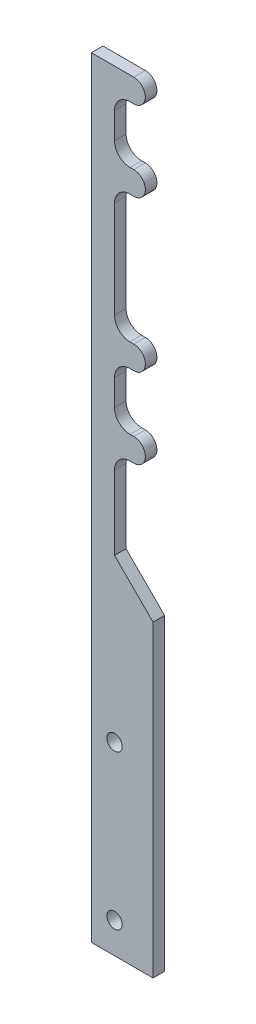
ISO-10303-21;
HEADER;
FILE_DESCRIPTION(('STEP AP214'),'2;1');
FILE_NAME('part.step','',(''),(''),'','','');
FILE_SCHEMA(('AUTOMOTIVE_DESIGN { 1 0 10303 214 1 1 1 1 }'));
ENDSEC;
DATA;
#1=APPLICATION_CONTEXT('core data for automotive mechanical design processes');
#2=APPLICATION_PROTOCOL_DEFINITION('international standard','automotive_design',2000,#1);
#3=PRODUCT_CONTEXT('',#1,'mechanical');
#4=PRODUCT('Part','Part','',(#3));
#5=PRODUCT_RELATED_PRODUCT_CATEGORY('part','',(#4));
#6=PRODUCT_DEFINITION_FORMATION('','',#4);
#7=PRODUCT_DEFINITION_CONTEXT('part definition',#1,'design');
#8=PRODUCT_DEFINITION('design','',#6,#7);
#9=PRODUCT_DEFINITION_SHAPE('','',#8);
#10=(LENGTH_UNIT() NAMED_UNIT(*) SI_UNIT(.MILLI.,.METRE.));
#11=(NAMED_UNIT(*) PLANE_ANGLE_UNIT() SI_UNIT($,.RADIAN.));
#12=(NAMED_UNIT(*) SI_UNIT($,.STERADIAN.) SOLID_ANGLE_UNIT());
#13=UNCERTAINTY_MEASURE_WITH_UNIT(LENGTH_MEASURE(1.E-05),#10,'distance_accuracy_value','');
#14=(GEOMETRIC_REPRESENTATION_CONTEXT(3) GLOBAL_UNCERTAINTY_ASSIGNED_CONTEXT((#13)) GLOBAL_UNIT_ASSIGNED_CONTEXT((#10,
#11,#12)) REPRESENTATION_CONTEXT('',''));
#15=CARTESIAN_POINT('',(0.,0.,0.));
#16=DIRECTION('',(0.,0.,1.));
#17=DIRECTION('',(1.,0.,0.));
#18=AXIS2_PLACEMENT_3D('',#15,#16,#17);
#19=CARTESIAN_POINT('',(0.,-51.6961524227066,1.5));
#20=DIRECTION('',(0.,1.,0.));
#21=DIRECTION('',(0.,0.,1.));
#22=AXIS2_PLACEMENT_3D('',#19,#20,#21);
#23=PLANE('',#22);
#24=DIRECTION('',(1.,0.,0.));
#25=VECTOR('',#24,1.);
#26=CARTESIAN_POINT('',(0.,-51.6961524227066,1.5));
#27=LINE('',#26,#25);
#28=CARTESIAN_POINT('',(-3.49999999999998,-51.6961524227066,1.5));
#29=VERTEX_POINT('',#28);
#30=CARTESIAN_POINT('',(-3.,-51.6961524227066,1.5));
#31=VERTEX_POINT('',#30);
#32=EDGE_CURVE('E216',#29,#31,#27,.T.);
#33=ORIENTED_EDGE('',*,*,#32,.F.);
#34=DIRECTION('',(0.,0.,-1.));
#35=VECTOR('',#34,1.);
#36=CARTESIAN_POINT('',(-3.49999999999998,-51.6961524227066,0.));
#37=LINE('',#36,#35);
#38=CARTESIAN_POINT('',(-3.49999999999998,-51.6961524227066,0.));
#39=VERTEX_POINT('',#38);
#40=EDGE_CURVE('E243',#29,#39,#37,.T.);
#41=ORIENTED_EDGE('',*,*,#40,.T.);
#42=DIRECTION('',(1.,0.,0.));
#43=VECTOR('',#42,1.);
#44=CARTESIAN_POINT('',(0.,-51.6961524227066,0.));
#45=LINE('',#44,#43);
#46=CARTESIAN_POINT('',(-3.,-51.6961524227066,0.));
#47=VERTEX_POINT('',#46);
#48=EDGE_CURVE('E241',#39,#47,#45,.T.);
#49=ORIENTED_EDGE('',*,*,#48,.T.);
#50=DIRECTION('',(0.,0.,-1.));
#51=VECTOR('',#50,1.);
#52=CARTESIAN_POINT('',(-3.,-51.6961524227066,1.5));
#53=LINE('',#52,#51);
#54=EDGE_CURVE('E235',#31,#47,#53,.T.);
#55=ORIENTED_EDGE('',*,*,#54,.F.);
#56=EDGE_LOOP('',(#33,#41,#49,#55));
#57=FACE_BOUND('',#56,.T.);
#58=ADVANCED_FACE('F36',(#57),#23,.F.);
#59=CARTESIAN_POINT('',(-3.,-50.1961524227066,1.5));
#60=DIRECTION('',(0.,0.,-1.));
#61=DIRECTION('',(-1.,0.,0.));
#62=AXIS2_PLACEMENT_3D('',#59,#60,#61);
#63=CYLINDRICAL_SURFACE('',#62,1.5);
#64=CARTESIAN_POINT('',(-3.,-50.1961524227066,0.));
#65=DIRECTION('',(0.,0.,1.));
#66=DIRECTION('',(1.,0.,0.));
#67=AXIS2_PLACEMENT_3D('',#64,#65,#66);
#68=CIRCLE('',#67,1.5);
#69=CARTESIAN_POINT('',(-3.,-48.6961524227066,0.));
#70=VERTEX_POINT('',#69);
#71=EDGE_CURVE('E362',#47,#70,#68,.T.);
#72=ORIENTED_EDGE('',*,*,#71,.T.);
#73=DIRECTION('',(0.,0.,-1.));
#74=VECTOR('',#73,1.);
#75=CARTESIAN_POINT('',(-3.,-48.6961524227066,1.5));
#76=LINE('',#75,#74);
#77=CARTESIAN_POINT('',(-3.,-48.6961524227066,1.5));
#78=VERTEX_POINT('',#77);
#79=EDGE_CURVE('E237',#78,#70,#76,.T.);
#80=ORIENTED_EDGE('',*,*,#79,.F.);
#81=CARTESIAN_POINT('',(-3.,-50.1961524227066,1.5));
#82=DIRECTION('',(0.,0.,1.));
#83=DIRECTION('',(1.,0.,0.));
#84=AXIS2_PLACEMENT_3D('',#81,#82,#83);
#85=CIRCLE('',#84,1.5);
#86=EDGE_CURVE('E221',#31,#78,#85,.T.);
#87=ORIENTED_EDGE('',*,*,#86,.F.);
#88=ORIENTED_EDGE('',*,*,#54,.T.);
#89=EDGE_LOOP('',(#72,#80,#87,#88));
#90=FACE_BOUND('',#89,.T.);
#91=ADVANCED_FACE('F234',(#90),#63,.T.);
#92=CARTESIAN_POINT('',(0.,-48.6961524227066,1.5));
#93=DIRECTION('',(0.,1.,0.));
#94=DIRECTION('',(0.,0.,1.));
#95=AXIS2_PLACEMENT_3D('',#92,#93,#94);
#96=PLANE('',#95);
#97=DIRECTION('',(1.,0.,0.));
#98=VECTOR('',#97,1.);
#99=CARTESIAN_POINT('',(0.,-48.6961524227066,0.));
#100=LINE('',#99,#98);
#101=CARTESIAN_POINT('',(-3.49999999999998,-48.6961524227066,0.));
#102=VERTEX_POINT('',#101);
#103=EDGE_CURVE('E364',#102,#70,#100,.T.);
#104=ORIENTED_EDGE('',*,*,#103,.F.);
#105=DIRECTION('',(0.,0.,-1.));
#106=VECTOR('',#105,1.);
#107=CARTESIAN_POINT('',(-3.49999999999998,-48.6961524227066,1.5));
#108=LINE('',#107,#106);
#109=CARTESIAN_POINT('',(-3.49999999999998,-48.6961524227066,1.5));
#110=VERTEX_POINT('',#109);
#111=EDGE_CURVE('E257',#102,#110,#108,.F.);
#112=ORIENTED_EDGE('',*,*,#111,.T.);
#113=DIRECTION('',(1.,0.,0.));
#114=VECTOR('',#113,1.);
#115=CARTESIAN_POINT('',(0.,-48.6961524227066,1.5));
#116=LINE('',#115,#114);
#117=EDGE_CURVE('E238',#110,#78,#116,.T.);
#118=ORIENTED_EDGE('',*,*,#117,.T.);
#119=ORIENTED_EDGE('',*,*,#79,.T.);
#120=EDGE_LOOP('',(#104,#112,#118,#119));
#121=FACE_BOUND('',#120,.T.);
#122=ADVANCED_FACE('F462',(#121),#96,.T.);
#123=CARTESIAN_POINT('',(-5.49999999999998,0.,1.5));
#124=DIRECTION('',(1.,0.,0.));
#125=DIRECTION('',(0.,0.,-1.));
#126=AXIS2_PLACEMENT_3D('',#123,#124,#125);
#127=PLANE('',#126);
#128=DIRECTION('',(0.,-1.,0.));
#129=VECTOR('',#128,1.);
#130=CARTESIAN_POINT('',(-5.49999999999998,0.,1.5));
#131=LINE('',#130,#129);
#132=CARTESIAN_POINT('',(-5.49999999999998,-43.3038475772934,1.5));
#133=VERTEX_POINT('',#132);
#134=CARTESIAN_POINT('',(-5.49999999999998,-46.6961524227066,1.5));
#135=VERTEX_POINT('',#134);
#136=EDGE_CURVE('E319',#133,#135,#131,.T.);
#137=ORIENTED_EDGE('',*,*,#136,.T.);
#138=DIRECTION('',(0.,0.,-1.));
#139=VECTOR('',#138,1.);
#140=CARTESIAN_POINT('',(-5.49999999999998,-46.6961524227066,0.));
#141=LINE('',#140,#139);
#142=CARTESIAN_POINT('',(-5.49999999999998,-46.6961524227066,0.));
#143=VERTEX_POINT('',#142);
#144=EDGE_CURVE('E254',#135,#143,#141,.T.);
#145=ORIENTED_EDGE('',*,*,#144,.T.);
#146=DIRECTION('',(0.,-1.,0.));
#147=VECTOR('',#146,1.);
#148=CARTESIAN_POINT('',(-5.49999999999998,0.,0.));
#149=LINE('',#148,#147);
#150=CARTESIAN_POINT('',(-5.49999999999998,-43.3038475772934,0.));
#151=VERTEX_POINT('',#150);
#152=EDGE_CURVE('E366',#151,#143,#149,.T.);
#153=ORIENTED_EDGE('',*,*,#152,.F.);
#154=DIRECTION('',(0.,0.,-1.));
#155=VECTOR('',#154,1.);
#156=CARTESIAN_POINT('',(-5.49999999999998,-43.3038475772934,1.5));
#157=LINE('',#156,#155);
#158=EDGE_CURVE('E252',#151,#133,#157,.F.);
#159=ORIENTED_EDGE('',*,*,#158,.T.);
#160=EDGE_LOOP('',(#137,#145,#153,#159));
#161=FACE_BOUND('',#160,.T.);
#162=ADVANCED_FACE('F453',(#161),#127,.T.);
#163=CARTESIAN_POINT('',(0.,-41.3038475772934,1.5));
#164=DIRECTION('',(0.,-1.,0.));
#165=DIRECTION('',(0.,0.,-1.));
#166=AXIS2_PLACEMENT_3D('',#163,#164,#165);
#167=PLANE('',#166);
#168=DIRECTION('',(-1.,0.,0.));
#169=VECTOR('',#168,1.);
#170=CARTESIAN_POINT('',(0.,-41.3038475772934,1.5));
#171=LINE('',#170,#169);
#172=CARTESIAN_POINT('',(-3.,-41.3038475772934,1.5));
#173=VERTEX_POINT('',#172);
#174=CARTESIAN_POINT('',(-3.49999999999998,-41.3038475772934,1.5));
#175=VERTEX_POINT('',#174);
#176=EDGE_CURVE('E322',#173,#175,#171,.T.);
#177=ORIENTED_EDGE('',*,*,#176,.T.);
#178=DIRECTION('',(0.,0.,-1.));
#179=VECTOR('',#178,1.);
#180=CARTESIAN_POINT('',(-3.49999999999998,-41.3038475772934,0.));
#181=LINE('',#180,#179);
#182=CARTESIAN_POINT('',(-3.49999999999998,-41.3038475772934,0.));
#183=VERTEX_POINT('',#182);
#184=EDGE_CURVE('E259',#175,#183,#181,.T.);
#185=ORIENTED_EDGE('',*,*,#184,.T.);
#186=DIRECTION('',(-1.,0.,0.));
#187=VECTOR('',#186,1.);
#188=CARTESIAN_POINT('',(0.,-41.3038475772934,0.));
#189=LINE('',#188,#187);
#190=CARTESIAN_POINT('',(-3.,-41.3038475772934,0.));
#191=VERTEX_POINT('',#190);
#192=EDGE_CURVE('E369',#191,#183,#189,.T.);
#193=ORIENTED_EDGE('',*,*,#192,.F.);
#194=DIRECTION('',(0.,0.,-1.));
#195=VECTOR('',#194,1.);
#196=CARTESIAN_POINT('',(-3.,-41.3038475772934,1.5));
#197=LINE('',#196,#195);
#198=EDGE_CURVE('E247',#173,#191,#197,.T.);
#199=ORIENTED_EDGE('',*,*,#198,.F.);
#200=EDGE_LOOP('',(#177,#185,#193,#199));
#201=FACE_BOUND('',#200,.T.);
#202=ADVANCED_FACE('F445',(#201),#167,.T.);
#203=CARTESIAN_POINT('',(-3.,-39.8038475772934,1.5));
#204=DIRECTION('',(0.,0.,-1.));
#205=DIRECTION('',(-1.,0.,0.));
#206=AXIS2_PLACEMENT_3D('',#203,#204,#205);
#207=CYLINDRICAL_SURFACE('',#206,1.5);
#208=CARTESIAN_POINT('',(-3.,-39.8038475772934,0.));
#209=DIRECTION('',(0.,0.,1.));
#210=DIRECTION('',(1.,0.,0.));
#211=AXIS2_PLACEMENT_3D('',#208,#209,#210);
#212=CIRCLE('',#211,1.5);
#213=CARTESIAN_POINT('',(-3.,-38.3038475772934,0.));
#214=VERTEX_POINT('',#213);
#215=EDGE_CURVE('E372',#191,#214,#212,.T.);
#216=ORIENTED_EDGE('',*,*,#215,.T.);
#217=DIRECTION('',(0.,0.,-1.));
#218=VECTOR('',#217,1.);
#219=CARTESIAN_POINT('',(-3.,-38.3038475772934,1.5));
#220=LINE('',#219,#218);
#221=CARTESIAN_POINT('',(-3.,-38.3038475772934,1.5));
#222=VERTEX_POINT('',#221);
#223=EDGE_CURVE('E432',#222,#214,#220,.T.);
#224=ORIENTED_EDGE('',*,*,#223,.F.);
#225=CARTESIAN_POINT('',(-3.,-39.8038475772934,1.5));
#226=DIRECTION('',(0.,0.,1.));
#227=DIRECTION('',(1.,0.,0.));
#228=AXIS2_PLACEMENT_3D('',#225,#226,#227);
#229=CIRCLE('',#228,1.5);
#230=EDGE_CURVE('E325',#173,#222,#229,.T.);
#231=ORIENTED_EDGE('',*,*,#230,.F.);
#232=ORIENTED_EDGE('',*,*,#198,.T.);
#233=EDGE_LOOP('',(#216,#224,#231,#232));
#234=FACE_BOUND('',#233,.T.);
#235=ADVANCED_FACE('F437',(#234),#207,.T.);
#236=CARTESIAN_POINT('',(0.,-38.3038475772934,1.5));
#237=DIRECTION('',(0.,-1.,0.));
#238=DIRECTION('',(0.,0.,-1.));
#239=AXIS2_PLACEMENT_3D('',#236,#237,#238);
#240=PLANE('',#239);
#241=DIRECTION('',(-1.,0.,0.));
#242=VECTOR('',#241,1.);
#243=CARTESIAN_POINT('',(0.,-38.3038475772934,0.));
#244=LINE('',#243,#242);
#245=CARTESIAN_POINT('',(-3.49999999999998,-38.3038475772934,0.));
#246=VERTEX_POINT('',#245);
#247=EDGE_CURVE('E374',#214,#246,#244,.T.);
#248=ORIENTED_EDGE('',*,*,#247,.T.);
#249=DIRECTION('',(0.,0.,-1.));
#250=VECTOR('',#249,1.);
#251=CARTESIAN_POINT('',(-3.49999999999998,-38.3038475772934,1.5));
#252=LINE('',#251,#250);
#253=CARTESIAN_POINT('',(-3.49999999999998,-38.3038475772934,1.5));
#254=VERTEX_POINT('',#253);
#255=EDGE_CURVE('E267',#246,#254,#252,.F.);
#256=ORIENTED_EDGE('',*,*,#255,.T.);
#257=DIRECTION('',(-1.,0.,0.));
#258=VECTOR('',#257,1.);
#259=CARTESIAN_POINT('',(0.,-38.3038475772934,1.5));
#260=LINE('',#259,#258);
#261=EDGE_CURVE('E327',#222,#254,#260,.T.);
#262=ORIENTED_EDGE('',*,*,#261,.F.);
#263=ORIENTED_EDGE('',*,*,#223,.T.);
#264=EDGE_LOOP('',(#248,#256,#262,#263));
#265=FACE_BOUND('',#264,.T.);
#266=ADVANCED_FACE('F496',(#265),#240,.F.);
#267=CARTESIAN_POINT('',(-5.49999999999999,0.,1.5));
#268=DIRECTION('',(1.,0.,0.));
#269=DIRECTION('',(0.,1.,0.));
#270=AXIS2_PLACEMENT_3D('',#267,#268,#269);
#271=PLANE('',#270);
#272=DIRECTION('',(0.,-1.,0.));
#273=VECTOR('',#272,1.);
#274=CARTESIAN_POINT('',(-5.49999999999999,0.,1.5));
#275=LINE('',#274,#273);
#276=CARTESIAN_POINT('',(-5.49999999999998,-23.6961524227067,1.5));
#277=VERTEX_POINT('',#276);
#278=CARTESIAN_POINT('',(-5.49999999999998,-36.3038475772934,1.5));
#279=VERTEX_POINT('',#278);
#280=EDGE_CURVE('E330',#277,#279,#275,.T.);
#281=ORIENTED_EDGE('',*,*,#280,.T.);
#282=DIRECTION('',(0.,0.,-1.));
#283=VECTOR('',#282,1.);
#284=CARTESIAN_POINT('',(-5.49999999999998,-36.3038475772934,1.5));
#285=LINE('',#284,#283);
#286=CARTESIAN_POINT('',(-5.49999999999998,-36.3038475772934,0.));
#287=VERTEX_POINT('',#286);
#288=EDGE_CURVE('E264',#279,#287,#285,.T.);
#289=ORIENTED_EDGE('',*,*,#288,.T.);
#290=DIRECTION('',(0.,-1.,0.));
#291=VECTOR('',#290,1.);
#292=CARTESIAN_POINT('',(-5.49999999999999,0.,0.));
#293=LINE('',#292,#291);
#294=CARTESIAN_POINT('',(-5.49999999999998,-23.6961524227067,0.));
#295=VERTEX_POINT('',#294);
#296=EDGE_CURVE('E377',#295,#287,#293,.T.);
#297=ORIENTED_EDGE('',*,*,#296,.F.);
#298=DIRECTION('',(0.,0.,-1.));
#299=VECTOR('',#298,1.);
#300=CARTESIAN_POINT('',(-5.49999999999998,-23.6961524227067,1.5));
#301=LINE('',#300,#299);
#302=EDGE_CURVE('E262',#295,#277,#301,.F.);
#303=ORIENTED_EDGE('',*,*,#302,.T.);
#304=EDGE_LOOP('',(#281,#289,#297,#303));
#305=FACE_BOUND('',#304,.T.);
#306=ADVANCED_FACE('F499',(#305),#271,.T.);
#307=CARTESIAN_POINT('',(0.,-21.6961524227066,1.5));
#308=DIRECTION('',(0.,-1.,0.));
#309=DIRECTION('',(0.,0.,-1.));
#310=AXIS2_PLACEMENT_3D('',#307,#308,#309);
#311=PLANE('',#310);
#312=DIRECTION('',(-1.,0.,0.));
#313=VECTOR('',#312,1.);
#314=CARTESIAN_POINT('',(0.,-21.6961524227066,1.5));
#315=LINE('',#314,#313);
#316=CARTESIAN_POINT('',(-3.,-21.6961524227066,1.5));
#317=VERTEX_POINT('',#316);
#318=CARTESIAN_POINT('',(-3.49999999999998,-21.6961524227066,1.5));
#319=VERTEX_POINT('',#318);
#320=EDGE_CURVE('E333',#317,#319,#315,.T.);
#321=ORIENTED_EDGE('',*,*,#320,.T.);
#322=DIRECTION('',(0.,0.,-1.));
#323=VECTOR('',#322,1.);
#324=CARTESIAN_POINT('',(-3.49999999999998,-21.6961524227066,0.));
#325=LINE('',#324,#323);
#326=CARTESIAN_POINT('',(-3.49999999999998,-21.6961524227066,0.));
#327=VERTEX_POINT('',#326);
#328=EDGE_CURVE('E269',#319,#327,#325,.T.);
#329=ORIENTED_EDGE('',*,*,#328,.T.);
#330=DIRECTION('',(-1.,0.,0.));
#331=VECTOR('',#330,1.);
#332=CARTESIAN_POINT('',(0.,-21.6961524227066,0.));
#333=LINE('',#332,#331);
#334=CARTESIAN_POINT('',(-3.,-21.6961524227066,0.));
#335=VERTEX_POINT('',#334);
#336=EDGE_CURVE('E380',#335,#327,#333,.T.);
#337=ORIENTED_EDGE('',*,*,#336,.F.);
#338=DIRECTION('',(0.,0.,-1.));
#339=VECTOR('',#338,1.);
#340=CARTESIAN_POINT('',(-3.,-21.6961524227066,1.5));
#341=LINE('',#340,#339);
#342=EDGE_CURVE('E430',#317,#335,#341,.T.);
#343=ORIENTED_EDGE('',*,*,#342,.F.);
#344=EDGE_LOOP('',(#321,#329,#337,#343));
#345=FACE_BOUND('',#344,.T.);
#346=ADVANCED_FACE('F503',(#345),#311,.T.);
#347=CARTESIAN_POINT('',(-3.,-20.1961524227066,1.5));
#348=DIRECTION('',(0.,0.,-1.));
#349=DIRECTION('',(-1.,0.,0.));
#350=AXIS2_PLACEMENT_3D('',#347,#348,#349);
#351=CYLINDRICAL_SURFACE('',#350,1.5);
#352=CARTESIAN_POINT('',(-3.,-20.1961524227066,0.));
#353=DIRECTION('',(0.,0.,1.));
#354=DIRECTION('',(1.,0.,0.));
#355=AXIS2_PLACEMENT_3D('',#352,#353,#354);
#356=CIRCLE('',#355,1.5);
#357=CARTESIAN_POINT('',(-3.,-18.6961524227066,0.));
#358=VERTEX_POINT('',#357);
#359=EDGE_CURVE('E383',#335,#358,#356,.T.);
#360=ORIENTED_EDGE('',*,*,#359,.T.);
#361=DIRECTION('',(0.,0.,-1.));
#362=VECTOR('',#361,1.);
#363=CARTESIAN_POINT('',(-3.,-18.6961524227066,1.5));
#364=LINE('',#363,#362);
#365=CARTESIAN_POINT('',(-3.,-18.6961524227066,1.5));
#366=VERTEX_POINT('',#365);
#367=EDGE_CURVE('E427',#366,#358,#364,.T.);
#368=ORIENTED_EDGE('',*,*,#367,.F.);
#369=CARTESIAN_POINT('',(-3.,-20.1961524227066,1.5));
#370=DIRECTION('',(0.,0.,1.));
#371=DIRECTION('',(1.,0.,0.));
#372=AXIS2_PLACEMENT_3D('',#369,#370,#371);
#373=CIRCLE('',#372,1.5);
#374=EDGE_CURVE('E336',#317,#366,#373,.T.);
#375=ORIENTED_EDGE('',*,*,#374,.F.);
#376=ORIENTED_EDGE('',*,*,#342,.T.);
#377=EDGE_LOOP('',(#360,#368,#375,#376));
#378=FACE_BOUND('',#377,.T.);
#379=ADVANCED_FACE('F507',(#378),#351,.T.);
#380=CARTESIAN_POINT('',(0.,-18.6961524227066,1.5));
#381=DIRECTION('',(0.,1.,0.));
#382=DIRECTION('',(0.,0.,1.));
#383=AXIS2_PLACEMENT_3D('',#380,#381,#382);
#384=PLANE('',#383);
#385=DIRECTION('',(1.,0.,0.));
#386=VECTOR('',#385,1.);
#387=CARTESIAN_POINT('',(0.,-18.6961524227066,0.));
#388=LINE('',#387,#386);
#389=CARTESIAN_POINT('',(-3.49999999999998,-18.6961524227066,0.));
#390=VERTEX_POINT('',#389);
#391=EDGE_CURVE('E386',#390,#358,#388,.T.);
#392=ORIENTED_EDGE('',*,*,#391,.F.);
#393=DIRECTION('',(0.,0.,-1.));
#394=VECTOR('',#393,1.);
#395=CARTESIAN_POINT('',(-3.49999999999998,-18.6961524227066,1.5));
#396=LINE('',#395,#394);
#397=CARTESIAN_POINT('',(-3.49999999999998,-18.6961524227066,1.5));
#398=VERTEX_POINT('',#397);
#399=EDGE_CURVE('E277',#390,#398,#396,.F.);
#400=ORIENTED_EDGE('',*,*,#399,.T.);
#401=DIRECTION('',(1.,0.,0.));
#402=VECTOR('',#401,1.);
#403=CARTESIAN_POINT('',(0.,-18.6961524227066,1.5));
#404=LINE('',#403,#402);
#405=EDGE_CURVE('E339',#398,#366,#404,.T.);
#406=ORIENTED_EDGE('',*,*,#405,.T.);
#407=ORIENTED_EDGE('',*,*,#367,.T.);
#408=EDGE_LOOP('',(#392,#400,#406,#407));
#409=FACE_BOUND('',#408,.T.);
#410=ADVANCED_FACE('F511',(#409),#384,.T.);
#411=CARTESIAN_POINT('',(-5.49999999999998,0.,1.5));
#412=DIRECTION('',(1.,0.,0.));
#413=DIRECTION('',(0.,0.,-1.));
#414=AXIS2_PLACEMENT_3D('',#411,#412,#413);
#415=PLANE('',#414);
#416=DIRECTION('',(0.,-1.,0.));
#417=VECTOR('',#416,1.);
#418=CARTESIAN_POINT('',(-5.49999999999998,0.,1.5));
#419=LINE('',#418,#417);
#420=CARTESIAN_POINT('',(-5.49999999999998,-13.3038475772934,1.5));
#421=VERTEX_POINT('',#420);
#422=CARTESIAN_POINT('',(-5.49999999999998,-16.6961524227066,1.5));
#423=VERTEX_POINT('',#422);
#424=EDGE_CURVE('E341',#421,#423,#419,.T.);
#425=ORIENTED_EDGE('',*,*,#424,.T.);
#426=DIRECTION('',(0.,0.,-1.));
#427=VECTOR('',#426,1.);
#428=CARTESIAN_POINT('',(-5.49999999999998,-16.6961524227066,0.));
#429=LINE('',#428,#427);
#430=CARTESIAN_POINT('',(-5.49999999999998,-16.6961524227066,0.));
#431=VERTEX_POINT('',#430);
#432=EDGE_CURVE('E274',#423,#431,#429,.T.);
#433=ORIENTED_EDGE('',*,*,#432,.T.);
#434=DIRECTION('',(0.,-1.,0.));
#435=VECTOR('',#434,1.);
#436=CARTESIAN_POINT('',(-5.49999999999998,0.,0.));
#437=LINE('',#436,#435);
#438=CARTESIAN_POINT('',(-5.49999999999998,-13.3038475772934,0.));
#439=VERTEX_POINT('',#438);
#440=EDGE_CURVE('E388',#439,#431,#437,.T.);
#441=ORIENTED_EDGE('',*,*,#440,.F.);
#442=DIRECTION('',(0.,0.,-1.));
#443=VECTOR('',#442,1.);
#444=CARTESIAN_POINT('',(-5.49999999999998,-13.3038475772934,1.5));
#445=LINE('',#444,#443);
#446=EDGE_CURVE('E272',#439,#421,#445,.F.);
#447=ORIENTED_EDGE('',*,*,#446,.T.);
#448=EDGE_LOOP('',(#425,#433,#441,#447));
#449=FACE_BOUND('',#448,.T.);
#450=ADVANCED_FACE('F515',(#449),#415,.T.);
#451=CARTESIAN_POINT('',(0.,-11.3038475772934,1.5));
#452=DIRECTION('',(0.,-1.,0.));
#453=DIRECTION('',(1.,0.,0.));
#454=AXIS2_PLACEMENT_3D('',#451,#452,#453);
#455=PLANE('',#454);
#456=DIRECTION('',(-1.,0.,0.));
#457=VECTOR('',#456,1.);
#458=CARTESIAN_POINT('',(0.,-11.3038475772934,1.5));
#459=LINE('',#458,#457);
#460=CARTESIAN_POINT('',(-3.,-11.3038475772934,1.5));
#461=VERTEX_POINT('',#460);
#462=CARTESIAN_POINT('',(-3.49999999999999,-11.3038475772934,1.5));
#463=VERTEX_POINT('',#462);
#464=EDGE_CURVE('E344',#461,#463,#459,.T.);
#465=ORIENTED_EDGE('',*,*,#464,.T.);
#466=DIRECTION('',(0.,0.,-1.));
#467=VECTOR('',#466,1.);
#468=CARTESIAN_POINT('',(-3.49999999999999,-11.3038475772934,0.));
#469=LINE('',#468,#467);
#470=CARTESIAN_POINT('',(-3.49999999999999,-11.3038475772934,0.));
#471=VERTEX_POINT('',#470);
#472=EDGE_CURVE('E279',#463,#471,#469,.T.);
#473=ORIENTED_EDGE('',*,*,#472,.T.);
#474=DIRECTION('',(-1.,0.,0.));
#475=VECTOR('',#474,1.);
#476=CARTESIAN_POINT('',(0.,-11.3038475772934,0.));
#477=LINE('',#476,#475);
#478=CARTESIAN_POINT('',(-3.,-11.3038475772934,0.));
#479=VERTEX_POINT('',#478);
#480=EDGE_CURVE('E391',#479,#471,#477,.T.);
#481=ORIENTED_EDGE('',*,*,#480,.F.);
#482=DIRECTION('',(0.,0.,-1.));
#483=VECTOR('',#482,1.);
#484=CARTESIAN_POINT('',(-3.,-11.3038475772934,1.5));
#485=LINE('',#484,#483);
#486=EDGE_CURVE('E425',#461,#479,#485,.T.);
#487=ORIENTED_EDGE('',*,*,#486,.F.);
#488=EDGE_LOOP('',(#465,#473,#481,#487));
#489=FACE_BOUND('',#488,.T.);
#490=ADVANCED_FACE('F519',(#489),#455,.T.);
#491=CARTESIAN_POINT('',(-3.,-9.80384757729339,1.5));
#492=DIRECTION('',(0.,0.,-1.));
#493=DIRECTION('',(-1.,0.,0.));
#494=AXIS2_PLACEMENT_3D('',#491,#492,#493);
#495=CYLINDRICAL_SURFACE('',#494,1.5);
#496=CARTESIAN_POINT('',(-3.,-9.80384757729339,0.));
#497=DIRECTION('',(0.,0.,1.));
#498=DIRECTION('',(1.,0.,0.));
#499=AXIS2_PLACEMENT_3D('',#496,#497,#498);
#500=CIRCLE('',#499,1.5);
#501=CARTESIAN_POINT('',(-3.,-8.30384757729339,0.));
#502=VERTEX_POINT('',#501);
#503=EDGE_CURVE('E394',#479,#502,#500,.T.);
#504=ORIENTED_EDGE('',*,*,#503,.T.);
#505=DIRECTION('',(0.,0.,-1.));
#506=VECTOR('',#505,1.);
#507=CARTESIAN_POINT('',(-3.,-8.30384757729339,1.5));
#508=LINE('',#507,#506);
#509=CARTESIAN_POINT('',(-3.,-8.30384757729339,1.5));
#510=VERTEX_POINT('',#509);
#511=EDGE_CURVE('E422',#510,#502,#508,.T.);
#512=ORIENTED_EDGE('',*,*,#511,.F.);
#513=CARTESIAN_POINT('',(-3.,-9.80384757729339,1.5));
#514=DIRECTION('',(0.,0.,1.));
#515=DIRECTION('',(1.,0.,0.));
#516=AXIS2_PLACEMENT_3D('',#513,#514,#515);
#517=CIRCLE('',#516,1.5);
#518=EDGE_CURVE('E346',#461,#510,#517,.T.);
#519=ORIENTED_EDGE('',*,*,#518,.F.);
#520=ORIENTED_EDGE('',*,*,#486,.T.);
#521=EDGE_LOOP('',(#504,#512,#519,#520));
#522=FACE_BOUND('',#521,.T.);
#523=ADVANCED_FACE('F523',(#522),#495,.T.);
#524=CARTESIAN_POINT('',(0.,-8.30384757729339,1.5));
#525=DIRECTION('',(0.,-1.,0.));
#526=DIRECTION('',(1.,0.,0.));
#527=AXIS2_PLACEMENT_3D('',#524,#525,#526);
#528=PLANE('',#527);
#529=DIRECTION('',(-1.,0.,0.));
#530=VECTOR('',#529,1.);
#531=CARTESIAN_POINT('',(0.,-8.30384757729339,0.));
#532=LINE('',#531,#530);
#533=CARTESIAN_POINT('',(-8.49999999999999,-8.30384757729338,0.));
#534=VERTEX_POINT('',#533);
#535=EDGE_CURVE('E396',#502,#534,#532,.T.);
#536=ORIENTED_EDGE('',*,*,#535,.T.);
#537=DIRECTION('',(0.,0.,-1.));
#538=VECTOR('',#537,1.);
#539=CARTESIAN_POINT('',(-8.49999999999999,-8.30384757729338,1.5));
#540=LINE('',#539,#538);
#541=CARTESIAN_POINT('',(-8.49999999999999,-8.30384757729338,1.5));
#542=VERTEX_POINT('',#541);
#543=EDGE_CURVE('E419',#542,#534,#540,.T.);
#544=ORIENTED_EDGE('',*,*,#543,.F.);
#545=DIRECTION('',(-1.,0.,0.));
#546=VECTOR('',#545,1.);
#547=CARTESIAN_POINT('',(0.,-8.30384757729339,1.5));
#548=LINE('',#547,#546);
#549=EDGE_CURVE('E348',#510,#542,#548,.T.);
#550=ORIENTED_EDGE('',*,*,#549,.F.);
#551=ORIENTED_EDGE('',*,*,#511,.T.);
#552=EDGE_LOOP('',(#536,#544,#550,#551));
#553=FACE_BOUND('',#552,.T.);
#554=ADVANCED_FACE('F527',(#553),#528,.F.);
#555=CARTESIAN_POINT('',(-8.49999999999999,0.,1.5));
#556=DIRECTION('',(1.,0.,0.));
#557=DIRECTION('',(0.,1.,0.));
#558=AXIS2_PLACEMENT_3D('',#555,#556,#557);
#559=PLANE('',#558);
#560=DIRECTION('',(0.,-1.,0.));
#561=VECTOR('',#560,1.);
#562=CARTESIAN_POINT('',(-8.49999999999999,0.,0.));
#563=LINE('',#562,#561);
#564=CARTESIAN_POINT('',(-8.49999999999998,-108.303847577293,0.));
#565=VERTEX_POINT('',#564);
#566=EDGE_CURVE('E398',#534,#565,#563,.T.);
#567=ORIENTED_EDGE('',*,*,#566,.T.);
#568=DIRECTION('',(0.,0.,-1.));
#569=VECTOR('',#568,1.);
#570=CARTESIAN_POINT('',(-8.49999999999998,-108.303847577293,1.5));
#571=LINE('',#570,#569);
#572=CARTESIAN_POINT('',(-8.49999999999998,-108.303847577293,1.5));
#573=VERTEX_POINT('',#572);
#574=EDGE_CURVE('E416',#573,#565,#571,.T.);
#575=ORIENTED_EDGE('',*,*,#574,.F.);
#576=DIRECTION('',(0.,-1.,0.));
#577=VECTOR('',#576,1.);
#578=CARTESIAN_POINT('',(-8.49999999999999,0.,1.5));
#579=LINE('',#578,#577);
#580=EDGE_CURVE('E350',#542,#573,#579,.T.);
#581=ORIENTED_EDGE('',*,*,#580,.F.);
#582=ORIENTED_EDGE('',*,*,#543,.T.);
#583=EDGE_LOOP('',(#567,#575,#581,#582));
#584=FACE_BOUND('',#583,.T.);
#585=ADVANCED_FACE('F531',(#584),#559,.F.);
#586=CARTESIAN_POINT('',(0.,-108.303847577293,1.5));
#587=DIRECTION('',(0.,1.,0.));
#588=DIRECTION('',(0.,0.,1.));
#589=AXIS2_PLACEMENT_3D('',#586,#587,#588);
#590=PLANE('',#589);
#591=DIRECTION('',(1.,0.,0.));
#592=VECTOR('',#591,1.);
#593=CARTESIAN_POINT('',(0.,-108.303847577293,0.));
#594=LINE('',#593,#592);
#595=CARTESIAN_POINT('',(-0.499999999999979,-108.303847577293,0.));
#596=VERTEX_POINT('',#595);
#597=EDGE_CURVE('E400',#565,#596,#594,.T.);
#598=ORIENTED_EDGE('',*,*,#597,.T.);
#599=DIRECTION('',(0.,0.,-1.));
#600=VECTOR('',#599,1.);
#601=CARTESIAN_POINT('',(-0.499999999999979,-108.303847577293,1.5));
#602=LINE('',#601,#600);
#603=CARTESIAN_POINT('',(-0.499999999999979,-108.303847577293,1.5));
#604=VERTEX_POINT('',#603);
#605=EDGE_CURVE('E413',#604,#596,#602,.T.);
#606=ORIENTED_EDGE('',*,*,#605,.F.);
#607=DIRECTION('',(1.,0.,0.));
#608=VECTOR('',#607,1.);
#609=CARTESIAN_POINT('',(0.,-108.303847577293,1.5));
#610=LINE('',#609,#608);
#611=EDGE_CURVE('E352',#573,#604,#610,.T.);
#612=ORIENTED_EDGE('',*,*,#611,.F.);
#613=ORIENTED_EDGE('',*,*,#574,.T.);
#614=EDGE_LOOP('',(#598,#606,#612,#613));
#615=FACE_BOUND('',#614,.T.);
#616=ADVANCED_FACE('F535',(#615),#590,.F.);
#617=CARTESIAN_POINT('',(-0.499999999999985,0.,1.5));
#618=DIRECTION('',(-1.,0.,0.));
#619=DIRECTION('',(0.,-1.,0.));
#620=AXIS2_PLACEMENT_3D('',#617,#618,#619);
#621=PLANE('',#620);
#622=DIRECTION('',(0.,1.,0.));
#623=VECTOR('',#622,1.);
#624=CARTESIAN_POINT('',(-0.499999999999985,0.,0.));
#625=LINE('',#624,#623);
#626=CARTESIAN_POINT('',(-0.499999999999981,-68.3038475772934,0.));
#627=VERTEX_POINT('',#626);
#628=EDGE_CURVE('E402',#596,#627,#625,.T.);
#629=ORIENTED_EDGE('',*,*,#628,.T.);
#630=DIRECTION('',(0.,0.,-1.));
#631=VECTOR('',#630,1.);
#632=CARTESIAN_POINT('',(-0.499999999999981,-68.3038475772934,1.5));
#633=LINE('',#632,#631);
#634=CARTESIAN_POINT('',(-0.499999999999981,-68.3038475772934,1.5));
#635=VERTEX_POINT('',#634);
#636=EDGE_CURVE('E410',#635,#627,#633,.T.);
#637=ORIENTED_EDGE('',*,*,#636,.F.);
#638=DIRECTION('',(0.,1.,0.));
#639=VECTOR('',#638,1.);
#640=CARTESIAN_POINT('',(-0.499999999999985,0.,1.5));
#641=LINE('',#640,#639);
#642=EDGE_CURVE('E354',#604,#635,#641,.T.);
#643=ORIENTED_EDGE('',*,*,#642,.F.);
#644=ORIENTED_EDGE('',*,*,#605,.T.);
#645=EDGE_LOOP('',(#629,#637,#643,#644));
#646=FACE_BOUND('',#645,.T.);
#647=ADVANCED_FACE('F539',(#646),#621,.F.);
#648=CARTESIAN_POINT('',(-34.4019237886467,-34.4019237886473,1.5));
#649=DIRECTION('',(-0.707106781186541,-0.707106781186553,0.));
#650=DIRECTION('',(0.707106781186554,-0.707106781186542,0.));
#651=AXIS2_PLACEMENT_3D('',#648,#649,#650);
#652=PLANE('',#651);
#653=DIRECTION('',(-0.707106781186554,0.707106781186542,0.));
#654=VECTOR('',#653,1.);
#655=CARTESIAN_POINT('',(-34.4019237886467,-34.4019237886473,0.));
#656=LINE('',#655,#654);
#657=CARTESIAN_POINT('',(-5.49999999999998,-63.3038475772935,0.));
#658=VERTEX_POINT('',#657);
#659=EDGE_CURVE('E404',#627,#658,#656,.T.);
#660=ORIENTED_EDGE('',*,*,#659,.T.);
#661=DIRECTION('',(0.,0.,-1.));
#662=VECTOR('',#661,1.);
#663=CARTESIAN_POINT('',(-5.49999999999998,-63.3038475772935,1.5));
#664=LINE('',#663,#662);
#665=CARTESIAN_POINT('',(-5.49999999999998,-63.3038475772935,1.5));
#666=VERTEX_POINT('',#665);
#667=EDGE_CURVE('E360',#666,#658,#664,.T.);
#668=ORIENTED_EDGE('',*,*,#667,.F.);
#669=DIRECTION('',(-0.707106781186554,0.707106781186542,0.));
#670=VECTOR('',#669,1.);
#671=CARTESIAN_POINT('',(-34.4019237886467,-34.4019237886473,1.5));
#672=LINE('',#671,#670);
#673=EDGE_CURVE('E356',#635,#666,#672,.T.);
#674=ORIENTED_EDGE('',*,*,#673,.F.);
#675=ORIENTED_EDGE('',*,*,#636,.T.);
#676=EDGE_LOOP('',(#660,#668,#674,#675));
#677=FACE_BOUND('',#676,.T.);
#678=ADVANCED_FACE('F543',(#677),#652,.F.);
#679=CARTESIAN_POINT('',(-5.49999999999996,0.,1.5));
#680=DIRECTION('',(-1.,0.,0.));
#681=DIRECTION('',(0.,-1.,0.));
#682=AXIS2_PLACEMENT_3D('',#679,#680,#681);
#683=PLANE('',#682);
#684=DIRECTION('',(0.,1.,0.));
#685=VECTOR('',#684,1.);
#686=CARTESIAN_POINT('',(-5.49999999999996,0.,0.));
#687=LINE('',#686,#685);
#688=CARTESIAN_POINT('',(-5.49999999999998,-53.6961524227066,0.));
#689=VERTEX_POINT('',#688);
#690=EDGE_CURVE('E229',#658,#689,#687,.T.);
#691=ORIENTED_EDGE('',*,*,#690,.T.);
#692=DIRECTION('',(0.,0.,-1.));
#693=VECTOR('',#692,1.);
#694=CARTESIAN_POINT('',(-5.49999999999998,-53.6961524227066,1.5));
#695=LINE('',#694,#693);
#696=CARTESIAN_POINT('',(-5.49999999999998,-53.6961524227066,1.5));
#697=VERTEX_POINT('',#696);
#698=EDGE_CURVE('E245',#689,#697,#695,.F.);
#699=ORIENTED_EDGE('',*,*,#698,.T.);
#700=DIRECTION('',(0.,1.,0.));
#701=VECTOR('',#700,1.);
#702=CARTESIAN_POINT('',(-5.49999999999996,0.,1.5));
#703=LINE('',#702,#701);
#704=EDGE_CURVE('E358',#666,#697,#703,.T.);
#705=ORIENTED_EDGE('',*,*,#704,.F.);
#706=ORIENTED_EDGE('',*,*,#667,.T.);
#707=EDGE_LOOP('',(#691,#699,#705,#706));
#708=FACE_BOUND('',#707,.T.);
#709=ADVANCED_FACE('F468',(#708),#683,.F.);
#710=CARTESIAN_POINT('',(0.,0.,1.5));
#711=DIRECTION('',(0.,0.,1.));
#712=DIRECTION('',(1.,0.,0.));
#713=AXIS2_PLACEMENT_3D('',#710,#711,#712);
#714=PLANE('',#713);
#715=CARTESIAN_POINT('',(-5.49999999999998,-104.303847577293,1.5));
#716=DIRECTION('',(0.,0.,1.));
#717=DIRECTION('',(1.,0.,0.));
#718=AXIS2_PLACEMENT_3D('',#715,#716,#717);
#719=CIRCLE('',#718,1.);
#720=CARTESIAN_POINT('',(-4.49999999999998,-104.303847577293,1.5));
#721=VERTEX_POINT('',#720);
#722=EDGE_CURVE('E306',#721,#721,#719,.T.);
#723=ORIENTED_EDGE('',*,*,#722,.F.);
#724=EDGE_LOOP('',(#723));
#725=FACE_BOUND('',#724,.T.);
#726=CARTESIAN_POINT('',(-5.49999999999998,-84.3038475772934,1.5));
#727=DIRECTION('',(0.,0.,1.));
#728=DIRECTION('',(1.,0.,0.));
#729=AXIS2_PLACEMENT_3D('',#726,#727,#728);
#730=CIRCLE('',#729,1.);
#731=CARTESIAN_POINT('',(-4.49999999999998,-84.3038475772934,1.5));
#732=VERTEX_POINT('',#731);
#733=EDGE_CURVE('E311',#732,#732,#730,.T.);
#734=ORIENTED_EDGE('',*,*,#733,.F.);
#735=EDGE_LOOP('',(#734));
#736=FACE_BOUND('',#735,.T.);
#737=ORIENTED_EDGE('',*,*,#704,.T.);
#738=CARTESIAN_POINT('',(-3.49999999999998,-53.6961524227066,1.5));
#739=DIRECTION('',(0.,0.,1.));
#740=DIRECTION('',(1.,0.,0.));
#741=AXIS2_PLACEMENT_3D('',#738,#739,#740);
#742=CIRCLE('',#741,2.);
#743=EDGE_CURVE('E224',#697,#29,#742,.F.);
#744=ORIENTED_EDGE('',*,*,#743,.T.);
#745=ORIENTED_EDGE('',*,*,#32,.T.);
#746=ORIENTED_EDGE('',*,*,#86,.T.);
#747=ORIENTED_EDGE('',*,*,#117,.F.);
#748=CARTESIAN_POINT('',(-3.49999999999998,-46.6961524227066,1.5));
#749=DIRECTION('',(0.,0.,1.));
#750=DIRECTION('',(1.,0.,0.));
#751=AXIS2_PLACEMENT_3D('',#748,#749,#750);
#752=CIRCLE('',#751,2.);
#753=EDGE_CURVE('E286',#110,#135,#752,.F.);
#754=ORIENTED_EDGE('',*,*,#753,.T.);
#755=ORIENTED_EDGE('',*,*,#136,.F.);
#756=CARTESIAN_POINT('',(-3.49999999999998,-43.3038475772934,1.5));
#757=DIRECTION('',(0.,0.,1.));
#758=DIRECTION('',(1.,0.,0.));
#759=AXIS2_PLACEMENT_3D('',#756,#757,#758);
#760=CIRCLE('',#759,2.);
#761=EDGE_CURVE('E290',#133,#175,#760,.F.);
#762=ORIENTED_EDGE('',*,*,#761,.T.);
#763=ORIENTED_EDGE('',*,*,#176,.F.);
#764=ORIENTED_EDGE('',*,*,#230,.T.);
#765=ORIENTED_EDGE('',*,*,#261,.T.);
#766=CARTESIAN_POINT('',(-3.49999999999998,-36.3038475772934,1.5));
#767=DIRECTION('',(0.,0.,1.));
#768=DIRECTION('',(1.,0.,0.));
#769=AXIS2_PLACEMENT_3D('',#766,#767,#768);
#770=CIRCLE('',#769,2.);
#771=EDGE_CURVE('E294',#254,#279,#770,.F.);
#772=ORIENTED_EDGE('',*,*,#771,.T.);
#773=ORIENTED_EDGE('',*,*,#280,.F.);
#774=CARTESIAN_POINT('',(-3.49999999999998,-23.6961524227067,1.5));
#775=DIRECTION('',(0.,0.,1.));
#776=DIRECTION('',(1.,0.,0.));
#777=AXIS2_PLACEMENT_3D('',#774,#775,#776);
#778=CIRCLE('',#777,2.);
#779=EDGE_CURVE('E298',#277,#319,#778,.F.);
#780=ORIENTED_EDGE('',*,*,#779,.T.);
#781=ORIENTED_EDGE('',*,*,#320,.F.);
#782=ORIENTED_EDGE('',*,*,#374,.T.);
#783=ORIENTED_EDGE('',*,*,#405,.F.);
#784=CARTESIAN_POINT('',(-3.49999999999998,-16.6961524227066,1.5));
#785=DIRECTION('',(0.,0.,1.));
#786=DIRECTION('',(1.,0.,0.));
#787=AXIS2_PLACEMENT_3D('',#784,#785,#786);
#788=CIRCLE('',#787,2.);
#789=EDGE_CURVE('E302',#398,#423,#788,.F.);
#790=ORIENTED_EDGE('',*,*,#789,.T.);
#791=ORIENTED_EDGE('',*,*,#424,.F.);
#792=CARTESIAN_POINT('',(-3.49999999999998,-13.3038475772934,1.5));
#793=DIRECTION('',(0.,0.,1.));
#794=DIRECTION('',(1.,0.,0.));
#795=AXIS2_PLACEMENT_3D('',#792,#793,#794);
#796=CIRCLE('',#795,2.);
#797=EDGE_CURVE('E11',#421,#463,#796,.F.);
#798=ORIENTED_EDGE('',*,*,#797,.T.);
#799=ORIENTED_EDGE('',*,*,#464,.F.);
#800=ORIENTED_EDGE('',*,*,#518,.T.);
#801=ORIENTED_EDGE('',*,*,#549,.T.);
#802=ORIENTED_EDGE('',*,*,#580,.T.);
#803=ORIENTED_EDGE('',*,*,#611,.T.);
#804=ORIENTED_EDGE('',*,*,#642,.T.);
#805=ORIENTED_EDGE('',*,*,#673,.T.);
#806=EDGE_LOOP('',(#737,#744,#745,#746,#747,#754,#755,#762,#763,#764,#765,#772,#773,#780,#781,
#782,#783,#790,#791,#798,#799,#800,#801,#802,#803,#804,#805));
#807=FACE_BOUND('',#806,.T.);
#808=ADVANCED_FACE('F219',(#725,#736,#807),#714,.T.);
#809=CARTESIAN_POINT('',(0.,0.,0.));
#810=DIRECTION('',(0.,0.,1.));
#811=DIRECTION('',(1.,0.,0.));
#812=AXIS2_PLACEMENT_3D('',#809,#810,#811);
#813=PLANE('',#812);
#814=CARTESIAN_POINT('',(-5.49999999999998,-104.303847577293,0.));
#815=DIRECTION('',(0.,0.,1.));
#816=DIRECTION('',(1.,0.,0.));
#817=AXIS2_PLACEMENT_3D('',#814,#815,#816);
#818=CIRCLE('',#817,1.);
#819=CARTESIAN_POINT('',(-4.49999999999998,-104.303847577293,0.));
#820=VERTEX_POINT('',#819);
#821=EDGE_CURVE('E40',#820,#820,#818,.T.);
#822=ORIENTED_EDGE('',*,*,#821,.T.);
#823=EDGE_LOOP('',(#822));
#824=FACE_BOUND('',#823,.T.);
#825=CARTESIAN_POINT('',(-5.49999999999998,-84.3038475772934,0.));
#826=DIRECTION('',(0.,0.,1.));
#827=DIRECTION('',(1.,0.,0.));
#828=AXIS2_PLACEMENT_3D('',#825,#826,#827);
#829=CIRCLE('',#828,1.);
#830=CARTESIAN_POINT('',(-4.49999999999998,-84.3038475772934,0.));
#831=VERTEX_POINT('',#830);
#832=EDGE_CURVE('E304',#831,#831,#829,.T.);
#833=ORIENTED_EDGE('',*,*,#832,.T.);
#834=EDGE_LOOP('',(#833));
#835=FACE_BOUND('',#834,.T.);
#836=ORIENTED_EDGE('',*,*,#48,.F.);
#837=CARTESIAN_POINT('',(-3.49999999999998,-53.6961524227066,0.));
#838=DIRECTION('',(0.,0.,1.));
#839=DIRECTION('',(1.,0.,0.));
#840=AXIS2_PLACEMENT_3D('',#837,#838,#839);
#841=CIRCLE('',#840,2.);
#842=EDGE_CURVE('E281',#39,#689,#841,.T.);
#843=ORIENTED_EDGE('',*,*,#842,.T.);
#844=ORIENTED_EDGE('',*,*,#690,.F.);
#845=ORIENTED_EDGE('',*,*,#659,.F.);
#846=ORIENTED_EDGE('',*,*,#628,.F.);
#847=ORIENTED_EDGE('',*,*,#597,.F.);
#848=ORIENTED_EDGE('',*,*,#566,.F.);
#849=ORIENTED_EDGE('',*,*,#535,.F.);
#850=ORIENTED_EDGE('',*,*,#503,.F.);
#851=ORIENTED_EDGE('',*,*,#480,.T.);
#852=CARTESIAN_POINT('',(-3.49999999999998,-13.3038475772934,0.));
#853=DIRECTION('',(0.,0.,1.));
#854=DIRECTION('',(1.,0.,0.));
#855=AXIS2_PLACEMENT_3D('',#852,#853,#854);
#856=CIRCLE('',#855,2.);
#857=EDGE_CURVE('E45',#471,#439,#856,.T.);
#858=ORIENTED_EDGE('',*,*,#857,.T.);
#859=ORIENTED_EDGE('',*,*,#440,.T.);
#860=CARTESIAN_POINT('',(-3.49999999999998,-16.6961524227066,0.));
#861=DIRECTION('',(0.,0.,1.));
#862=DIRECTION('',(1.,0.,0.));
#863=AXIS2_PLACEMENT_3D('',#860,#861,#862);
#864=CIRCLE('',#863,2.);
#865=EDGE_CURVE('E300',#431,#390,#864,.T.);
#866=ORIENTED_EDGE('',*,*,#865,.T.);
#867=ORIENTED_EDGE('',*,*,#391,.T.);
#868=ORIENTED_EDGE('',*,*,#359,.F.);
#869=ORIENTED_EDGE('',*,*,#336,.T.);
#870=CARTESIAN_POINT('',(-3.49999999999998,-23.6961524227067,0.));
#871=DIRECTION('',(0.,0.,1.));
#872=DIRECTION('',(1.,0.,0.));
#873=AXIS2_PLACEMENT_3D('',#870,#871,#872);
#874=CIRCLE('',#873,2.);
#875=EDGE_CURVE('E296',#327,#295,#874,.T.);
#876=ORIENTED_EDGE('',*,*,#875,.T.);
#877=ORIENTED_EDGE('',*,*,#296,.T.);
#878=CARTESIAN_POINT('',(-3.49999999999998,-36.3038475772934,0.));
#879=DIRECTION('',(0.,0.,1.));
#880=DIRECTION('',(1.,0.,0.));
#881=AXIS2_PLACEMENT_3D('',#878,#879,#880);
#882=CIRCLE('',#881,2.);
#883=EDGE_CURVE('E292',#287,#246,#882,.T.);
#884=ORIENTED_EDGE('',*,*,#883,.T.);
#885=ORIENTED_EDGE('',*,*,#247,.F.);
#886=ORIENTED_EDGE('',*,*,#215,.F.);
#887=ORIENTED_EDGE('',*,*,#192,.T.);
#888=CARTESIAN_POINT('',(-3.49999999999998,-43.3038475772934,0.));
#889=DIRECTION('',(0.,0.,1.));
#890=DIRECTION('',(1.,0.,0.));
#891=AXIS2_PLACEMENT_3D('',#888,#889,#890);
#892=CIRCLE('',#891,2.);
#893=EDGE_CURVE('E288',#183,#151,#892,.T.);
#894=ORIENTED_EDGE('',*,*,#893,.T.);
#895=ORIENTED_EDGE('',*,*,#152,.T.);
#896=CARTESIAN_POINT('',(-3.49999999999998,-46.6961524227066,0.));
#897=DIRECTION('',(0.,0.,1.));
#898=DIRECTION('',(1.,0.,0.));
#899=AXIS2_PLACEMENT_3D('',#896,#897,#898);
#900=CIRCLE('',#899,2.);
#901=EDGE_CURVE('E284',#143,#102,#900,.T.);
#902=ORIENTED_EDGE('',*,*,#901,.T.);
#903=ORIENTED_EDGE('',*,*,#103,.T.);
#904=ORIENTED_EDGE('',*,*,#71,.F.);
#905=EDGE_LOOP('',(#836,#843,#844,#845,#846,#847,#848,#849,#850,#851,#858,#859,#866,#867,#868,
#869,#876,#877,#884,#885,#886,#887,#894,#895,#902,#903,#904));
#906=FACE_BOUND('',#905,.T.);
#907=ADVANCED_FACE('F444',(#824,#835,#906),#813,.F.);
#908=CARTESIAN_POINT('',(-3.49999999999998,-53.6961524227066,1.5));
#909=DIRECTION('',(0.,0.,1.));
#910=DIRECTION('',(1.,0.,0.));
#911=AXIS2_PLACEMENT_3D('',#908,#909,#910);
#912=CYLINDRICAL_SURFACE('',#911,2.);
#913=ORIENTED_EDGE('',*,*,#743,.F.);
#914=ORIENTED_EDGE('',*,*,#698,.F.);
#915=ORIENTED_EDGE('',*,*,#842,.F.);
#916=ORIENTED_EDGE('',*,*,#40,.F.);
#917=EDGE_LOOP('',(#913,#914,#915,#916));
#918=FACE_BOUND('',#917,.T.);
#919=ADVANCED_FACE('F471',(#918),#912,.F.);
#920=CARTESIAN_POINT('',(-3.49999999999998,-46.6961524227066,1.5));
#921=DIRECTION('',(0.,0.,1.));
#922=DIRECTION('',(1.,0.,0.));
#923=AXIS2_PLACEMENT_3D('',#920,#921,#922);
#924=CYLINDRICAL_SURFACE('',#923,2.);
#925=ORIENTED_EDGE('',*,*,#753,.F.);
#926=ORIENTED_EDGE('',*,*,#111,.F.);
#927=ORIENTED_EDGE('',*,*,#901,.F.);
#928=ORIENTED_EDGE('',*,*,#144,.F.);
#929=EDGE_LOOP('',(#925,#926,#927,#928));
#930=FACE_BOUND('',#929,.T.);
#931=ADVANCED_FACE('F458',(#930),#924,.F.);
#932=CARTESIAN_POINT('',(-3.49999999999998,-43.3038475772934,1.5));
#933=DIRECTION('',(0.,0.,1.));
#934=DIRECTION('',(1.,0.,0.));
#935=AXIS2_PLACEMENT_3D('',#932,#933,#934);
#936=CYLINDRICAL_SURFACE('',#935,2.);
#937=ORIENTED_EDGE('',*,*,#761,.F.);
#938=ORIENTED_EDGE('',*,*,#158,.F.);
#939=ORIENTED_EDGE('',*,*,#893,.F.);
#940=ORIENTED_EDGE('',*,*,#184,.F.);
#941=EDGE_LOOP('',(#937,#938,#939,#940));
#942=FACE_BOUND('',#941,.T.);
#943=ADVANCED_FACE('F449',(#942),#936,.F.);
#944=CARTESIAN_POINT('',(-3.49999999999998,-36.3038475772934,1.5));
#945=DIRECTION('',(0.,0.,-1.));
#946=DIRECTION('',(-1.,0.,0.));
#947=AXIS2_PLACEMENT_3D('',#944,#945,#946);
#948=CYLINDRICAL_SURFACE('',#947,2.);
#949=ORIENTED_EDGE('',*,*,#771,.F.);
#950=ORIENTED_EDGE('',*,*,#255,.F.);
#951=ORIENTED_EDGE('',*,*,#883,.F.);
#952=ORIENTED_EDGE('',*,*,#288,.F.);
#953=EDGE_LOOP('',(#949,#950,#951,#952));
#954=FACE_BOUND('',#953,.T.);
#955=ADVANCED_FACE('F588',(#954),#948,.F.);
#956=CARTESIAN_POINT('',(-3.49999999999998,-23.6961524227067,1.5));
#957=DIRECTION('',(0.,0.,1.));
#958=DIRECTION('',(1.,0.,0.));
#959=AXIS2_PLACEMENT_3D('',#956,#957,#958);
#960=CYLINDRICAL_SURFACE('',#959,2.);
#961=ORIENTED_EDGE('',*,*,#779,.F.);
#962=ORIENTED_EDGE('',*,*,#302,.F.);
#963=ORIENTED_EDGE('',*,*,#875,.F.);
#964=ORIENTED_EDGE('',*,*,#328,.F.);
#965=EDGE_LOOP('',(#961,#962,#963,#964));
#966=FACE_BOUND('',#965,.T.);
#967=ADVANCED_FACE('F581',(#966),#960,.F.);
#968=CARTESIAN_POINT('',(-3.49999999999998,-16.6961524227066,1.5));
#969=DIRECTION('',(0.,0.,1.));
#970=DIRECTION('',(1.,0.,0.));
#971=AXIS2_PLACEMENT_3D('',#968,#969,#970);
#972=CYLINDRICAL_SURFACE('',#971,2.);
#973=ORIENTED_EDGE('',*,*,#789,.F.);
#974=ORIENTED_EDGE('',*,*,#399,.F.);
#975=ORIENTED_EDGE('',*,*,#865,.F.);
#976=ORIENTED_EDGE('',*,*,#432,.F.);
#977=EDGE_LOOP('',(#973,#974,#975,#976));
#978=FACE_BOUND('',#977,.T.);
#979=ADVANCED_FACE('F574',(#978),#972,.F.);
#980=CARTESIAN_POINT('',(-3.49999999999998,-13.3038475772934,1.5));
#981=DIRECTION('',(0.,0.,1.));
#982=DIRECTION('',(1.,0.,0.));
#983=AXIS2_PLACEMENT_3D('',#980,#981,#982);
#984=CYLINDRICAL_SURFACE('',#983,2.);
#985=ORIENTED_EDGE('',*,*,#797,.F.);
#986=ORIENTED_EDGE('',*,*,#446,.F.);
#987=ORIENTED_EDGE('',*,*,#857,.F.);
#988=ORIENTED_EDGE('',*,*,#472,.F.);
#989=EDGE_LOOP('',(#985,#986,#987,#988));
#990=FACE_BOUND('',#989,.T.);
#991=ADVANCED_FACE('F38',(#990),#984,.F.);
#992=CARTESIAN_POINT('',(-5.49999999999998,-84.3038475772934,-3.5));
#993=DIRECTION('',(0.,0.,1.));
#994=DIRECTION('',(1.,0.,0.));
#995=AXIS2_PLACEMENT_3D('',#992,#993,#994);
#996=CYLINDRICAL_SURFACE('',#995,1.);
#997=ORIENTED_EDGE('',*,*,#733,.T.);
#998=EDGE_LOOP('',(#997));
#999=FACE_BOUND('',#998,.T.);
#1000=ORIENTED_EDGE('',*,*,#832,.F.);
#1001=EDGE_LOOP('',(#1000));
#1002=FACE_BOUND('',#1001,.T.);
#1003=ADVANCED_FACE('F553',(#999,#1002),#996,.F.);
#1004=CARTESIAN_POINT('',(-5.49999999999998,-104.303847577293,-3.5));
#1005=DIRECTION('',(0.,0.,1.));
#1006=DIRECTION('',(1.,0.,0.));
#1007=AXIS2_PLACEMENT_3D('',#1004,#1005,#1006);
#1008=CYLINDRICAL_SURFACE('',#1007,1.);
#1009=ORIENTED_EDGE('',*,*,#722,.T.);
#1010=EDGE_LOOP('',(#1009));
#1011=FACE_BOUND('',#1010,.T.);
#1012=ORIENTED_EDGE('',*,*,#821,.F.);
#1013=EDGE_LOOP('',(#1012));
#1014=FACE_BOUND('',#1013,.T.);
#1015=ADVANCED_FACE('F556',(#1011,#1014),#1008,.F.);
#1016=CLOSED_SHELL('',(#58,#91,#122,#162,#202,#235,#266,#306,#346,#379,#410,#450,#490,#523,#554,
#585,#616,#647,#678,#709,#808,#907,#919,#931,#943,#955,#967,#979,#991,#1003,#1015));
#1017=MANIFOLD_SOLID_BREP('B2',#1016);
#1018=ADVANCED_BREP_SHAPE_REPRESENTATION('',(#18,#1017),#14);
#1019=SHAPE_DEFINITION_REPRESENTATION(#9,#1018);
ENDSEC;
END-ISO-10303-21;
